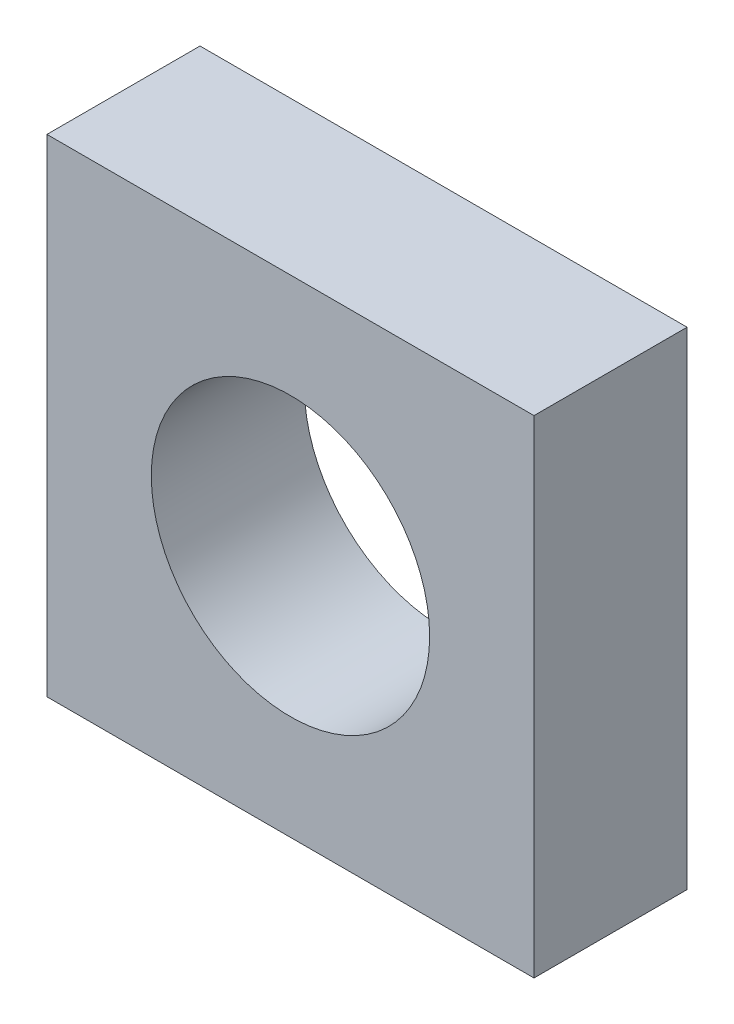
ISO-10303-21;
HEADER;
FILE_DESCRIPTION(('STEP AP214'),'2;1');
FILE_NAME('part.step','',(''),(''),'','','');
FILE_SCHEMA(('AUTOMOTIVE_DESIGN { 1 0 10303 214 1 1 1 1 }'));
ENDSEC;
DATA;
#1=APPLICATION_CONTEXT('core data for automotive mechanical design processes');
#2=APPLICATION_PROTOCOL_DEFINITION('international standard','automotive_design',2000,#1);
#3=PRODUCT_CONTEXT('',#1,'mechanical');
#4=PRODUCT('Part','Part','',(#3));
#5=PRODUCT_RELATED_PRODUCT_CATEGORY('part','',(#4));
#6=PRODUCT_DEFINITION_FORMATION('','',#4);
#7=PRODUCT_DEFINITION_CONTEXT('part definition',#1,'design');
#8=PRODUCT_DEFINITION('design','',#6,#7);
#9=PRODUCT_DEFINITION_SHAPE('','',#8);
#10=(LENGTH_UNIT() NAMED_UNIT(*) SI_UNIT(.MILLI.,.METRE.));
#11=(NAMED_UNIT(*) PLANE_ANGLE_UNIT() SI_UNIT($,.RADIAN.));
#12=(NAMED_UNIT(*) SI_UNIT($,.STERADIAN.) SOLID_ANGLE_UNIT());
#13=UNCERTAINTY_MEASURE_WITH_UNIT(LENGTH_MEASURE(1.E-05),#10,'distance_accuracy_value','');
#14=(GEOMETRIC_REPRESENTATION_CONTEXT(3) GLOBAL_UNCERTAINTY_ASSIGNED_CONTEXT((#13)) GLOBAL_UNIT_ASSIGNED_CONTEXT((#10,
#11,#12)) REPRESENTATION_CONTEXT('',''));
#15=CARTESIAN_POINT('',(0.,0.,0.));
#16=DIRECTION('',(0.,0.,1.));
#17=DIRECTION('',(1.,0.,0.));
#18=AXIS2_PLACEMENT_3D('',#15,#16,#17);
#19=CARTESIAN_POINT('',(3.5,-3.5,2.2));
#20=DIRECTION('',(-1.,0.,0.));
#21=DIRECTION('',(0.,0.,1.));
#22=AXIS2_PLACEMENT_3D('',#19,#20,#21);
#23=PLANE('',#22);
#24=DIRECTION('',(0.,1.,0.));
#25=VECTOR('',#24,1.);
#26=CARTESIAN_POINT('',(3.5,-3.5,0.));
#27=LINE('',#26,#25);
#28=CARTESIAN_POINT('',(3.5,-3.5,0.));
#29=VERTEX_POINT('',#28);
#30=CARTESIAN_POINT('',(3.5,3.5,0.));
#31=VERTEX_POINT('',#30);
#32=EDGE_CURVE('E98',#29,#31,#27,.T.);
#33=ORIENTED_EDGE('',*,*,#32,.T.);
#34=DIRECTION('',(0.,0.,-1.));
#35=VECTOR('',#34,1.);
#36=CARTESIAN_POINT('',(3.5,3.5,2.2));
#37=LINE('',#36,#35);
#38=CARTESIAN_POINT('',(3.5,3.5,2.2));
#39=VERTEX_POINT('',#38);
#40=EDGE_CURVE('E11',#39,#31,#37,.T.);
#41=ORIENTED_EDGE('',*,*,#40,.F.);
#42=DIRECTION('',(0.,1.,0.));
#43=VECTOR('',#42,1.);
#44=CARTESIAN_POINT('',(3.5,-3.5,2.2));
#45=LINE('',#44,#43);
#46=CARTESIAN_POINT('',(3.5,-3.5,2.2));
#47=VERTEX_POINT('',#46);
#48=EDGE_CURVE('E86',#47,#39,#45,.T.);
#49=ORIENTED_EDGE('',*,*,#48,.F.);
#50=DIRECTION('',(0.,0.,-1.));
#51=VECTOR('',#50,1.);
#52=CARTESIAN_POINT('',(3.5,-3.5,2.2));
#53=LINE('',#52,#51);
#54=EDGE_CURVE('E94',#47,#29,#53,.T.);
#55=ORIENTED_EDGE('',*,*,#54,.T.);
#56=EDGE_LOOP('',(#33,#41,#49,#55));
#57=FACE_BOUND('',#56,.T.);
#58=ADVANCED_FACE('F35',(#57),#23,.F.);
#59=CARTESIAN_POINT('',(-3.5,3.5,2.2));
#60=DIRECTION('',(0.,-1.,0.));
#61=DIRECTION('',(0.,0.,-1.));
#62=AXIS2_PLACEMENT_3D('',#59,#60,#61);
#63=PLANE('',#62);
#64=DIRECTION('',(-1.,0.,0.));
#65=VECTOR('',#64,1.);
#66=CARTESIAN_POINT('',(-3.5,3.5,0.));
#67=LINE('',#66,#65);
#68=CARTESIAN_POINT('',(-3.5,3.5,0.));
#69=VERTEX_POINT('',#68);
#70=EDGE_CURVE('E90',#31,#69,#67,.T.);
#71=ORIENTED_EDGE('',*,*,#70,.T.);
#72=DIRECTION('',(0.,0.,-1.));
#73=VECTOR('',#72,1.);
#74=CARTESIAN_POINT('',(-3.5,3.5,2.2));
#75=LINE('',#74,#73);
#76=CARTESIAN_POINT('',(-3.5,3.5,2.2));
#77=VERTEX_POINT('',#76);
#78=EDGE_CURVE('E43',#77,#69,#75,.T.);
#79=ORIENTED_EDGE('',*,*,#78,.F.);
#80=DIRECTION('',(-1.,0.,0.));
#81=VECTOR('',#80,1.);
#82=CARTESIAN_POINT('',(-3.5,3.5,2.2));
#83=LINE('',#82,#81);
#84=EDGE_CURVE('E81',#39,#77,#83,.T.);
#85=ORIENTED_EDGE('',*,*,#84,.F.);
#86=ORIENTED_EDGE('',*,*,#40,.T.);
#87=EDGE_LOOP('',(#71,#79,#85,#86));
#88=FACE_BOUND('',#87,.T.);
#89=ADVANCED_FACE('F89',(#88),#63,.F.);
#90=CARTESIAN_POINT('',(-3.5,-3.5,2.2));
#91=DIRECTION('',(1.,0.,0.));
#92=DIRECTION('',(0.,0.,-1.));
#93=AXIS2_PLACEMENT_3D('',#90,#91,#92);
#94=PLANE('',#93);
#95=DIRECTION('',(0.,-1.,0.));
#96=VECTOR('',#95,1.);
#97=CARTESIAN_POINT('',(-3.5,-3.5,0.));
#98=LINE('',#97,#96);
#99=CARTESIAN_POINT('',(-3.5,-3.5,0.));
#100=VERTEX_POINT('',#99);
#101=EDGE_CURVE('E68',#69,#100,#98,.T.);
#102=ORIENTED_EDGE('',*,*,#101,.T.);
#103=DIRECTION('',(0.,0.,-1.));
#104=VECTOR('',#103,1.);
#105=CARTESIAN_POINT('',(-3.5,-3.5,2.2));
#106=LINE('',#105,#104);
#107=CARTESIAN_POINT('',(-3.5,-3.5,2.2));
#108=VERTEX_POINT('',#107);
#109=EDGE_CURVE('E91',#108,#100,#106,.T.);
#110=ORIENTED_EDGE('',*,*,#109,.F.);
#111=DIRECTION('',(0.,-1.,0.));
#112=VECTOR('',#111,1.);
#113=CARTESIAN_POINT('',(-3.5,-3.5,2.2));
#114=LINE('',#113,#112);
#115=EDGE_CURVE('E84',#77,#108,#114,.T.);
#116=ORIENTED_EDGE('',*,*,#115,.F.);
#117=ORIENTED_EDGE('',*,*,#78,.T.);
#118=EDGE_LOOP('',(#102,#110,#116,#117));
#119=FACE_BOUND('',#118,.T.);
#120=ADVANCED_FACE('F92',(#119),#94,.F.);
#121=CARTESIAN_POINT('',(-3.5,-3.5,2.2));
#122=DIRECTION('',(0.,1.,0.));
#123=DIRECTION('',(0.,0.,1.));
#124=AXIS2_PLACEMENT_3D('',#121,#122,#123);
#125=PLANE('',#124);
#126=DIRECTION('',(1.,0.,0.));
#127=VECTOR('',#126,1.);
#128=CARTESIAN_POINT('',(-3.5,-3.5,0.));
#129=LINE('',#128,#127);
#130=EDGE_CURVE('E74',#100,#29,#129,.T.);
#131=ORIENTED_EDGE('',*,*,#130,.T.);
#132=ORIENTED_EDGE('',*,*,#54,.F.);
#133=DIRECTION('',(1.,0.,0.));
#134=VECTOR('',#133,1.);
#135=CARTESIAN_POINT('',(-3.5,-3.5,2.2));
#136=LINE('',#135,#134);
#137=EDGE_CURVE('E51',#108,#47,#136,.T.);
#138=ORIENTED_EDGE('',*,*,#137,.F.);
#139=ORIENTED_EDGE('',*,*,#109,.T.);
#140=EDGE_LOOP('',(#131,#132,#138,#139));
#141=FACE_BOUND('',#140,.T.);
#142=ADVANCED_FACE('F106',(#141),#125,.F.);
#143=CARTESIAN_POINT('',(0.,0.,2.2));
#144=DIRECTION('',(0.,0.,-1.));
#145=DIRECTION('',(-1.,0.,0.));
#146=AXIS2_PLACEMENT_3D('',#143,#144,#145);
#147=PLANE('',#146);
#148=CARTESIAN_POINT('',(0.000165227911594432,0.00184592230534254,2.2));
#149=DIRECTION('',(0.,0.,1.));
#150=DIRECTION('',(1.,0.,0.));
#151=AXIS2_PLACEMENT_3D('',#148,#149,#150);
#152=CIRCLE('',#151,2.);
#153=CARTESIAN_POINT('',(2.00016522791159,0.00184592230534254,2.2));
#154=VERTEX_POINT('',#153);
#155=EDGE_CURVE('E112',#154,#154,#152,.T.);
#156=ORIENTED_EDGE('',*,*,#155,.F.);
#157=EDGE_LOOP('',(#156));
#158=FACE_BOUND('',#157,.T.);
#159=ORIENTED_EDGE('',*,*,#48,.T.);
#160=ORIENTED_EDGE('',*,*,#84,.T.);
#161=ORIENTED_EDGE('',*,*,#115,.T.);
#162=ORIENTED_EDGE('',*,*,#137,.T.);
#163=EDGE_LOOP('',(#159,#160,#161,#162));
#164=FACE_BOUND('',#163,.T.);
#165=ADVANCED_FACE('F82',(#158,#164),#147,.F.);
#166=CARTESIAN_POINT('',(0.,0.,0.));
#167=DIRECTION('',(0.,0.,-1.));
#168=DIRECTION('',(-1.,0.,0.));
#169=AXIS2_PLACEMENT_3D('',#166,#167,#168);
#170=PLANE('',#169);
#171=CARTESIAN_POINT('',(0.000165227911594432,0.00184592230534254,0.));
#172=DIRECTION('',(0.,0.,1.));
#173=DIRECTION('',(1.,0.,0.));
#174=AXIS2_PLACEMENT_3D('',#171,#172,#173);
#175=CIRCLE('',#174,2.);
#176=CARTESIAN_POINT('',(2.00016522791159,0.00184592230534254,0.));
#177=VERTEX_POINT('',#176);
#178=EDGE_CURVE('E101',#177,#177,#175,.T.);
#179=ORIENTED_EDGE('',*,*,#178,.T.);
#180=EDGE_LOOP('',(#179));
#181=FACE_BOUND('',#180,.T.);
#182=ORIENTED_EDGE('',*,*,#32,.F.);
#183=ORIENTED_EDGE('',*,*,#130,.F.);
#184=ORIENTED_EDGE('',*,*,#101,.F.);
#185=ORIENTED_EDGE('',*,*,#70,.F.);
#186=EDGE_LOOP('',(#182,#183,#184,#185));
#187=FACE_BOUND('',#186,.T.);
#188=ADVANCED_FACE('F109',(#181,#187),#170,.T.);
#189=CARTESIAN_POINT('',(0.000165227911594432,0.00184592230534254,0.));
#190=DIRECTION('',(0.,0.,1.));
#191=DIRECTION('',(1.,0.,0.));
#192=AXIS2_PLACEMENT_3D('',#189,#190,#191);
#193=CYLINDRICAL_SURFACE('',#192,2.);
#194=ORIENTED_EDGE('',*,*,#178,.F.);
#195=EDGE_LOOP('',(#194));
#196=FACE_BOUND('',#195,.T.);
#197=ORIENTED_EDGE('',*,*,#155,.T.);
#198=EDGE_LOOP('',(#197));
#199=FACE_BOUND('',#198,.T.);
#200=ADVANCED_FACE('F119',(#196,#199),#193,.F.);
#201=CLOSED_SHELL('',(#58,#89,#120,#142,#165,#188,#200));
#202=MANIFOLD_SOLID_BREP('B2',#201);
#203=ADVANCED_BREP_SHAPE_REPRESENTATION('',(#18,#202),#14);
#204=SHAPE_DEFINITION_REPRESENTATION(#9,#203);
ENDSEC;
END-ISO-10303-21;
